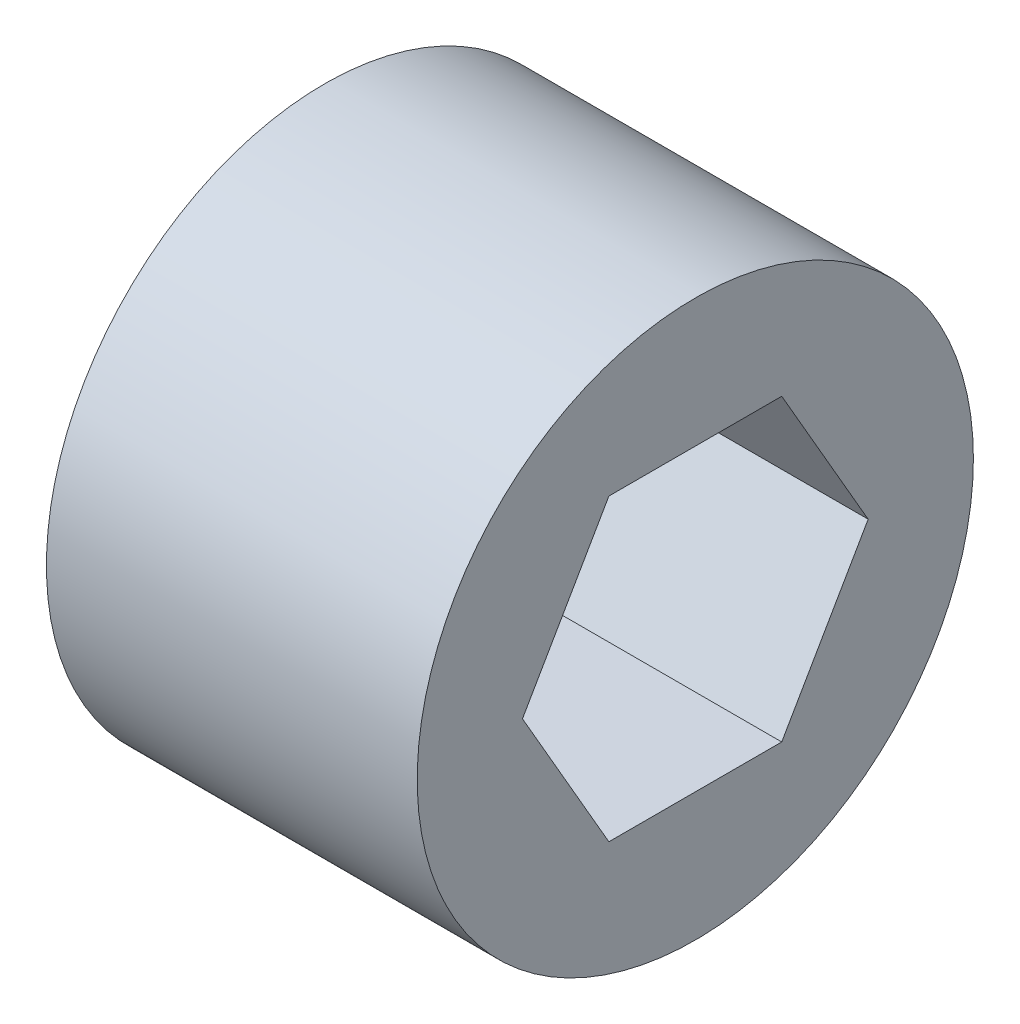
ISO-10303-21;
HEADER;
FILE_DESCRIPTION(('STEP AP214'),'2;1');
FILE_NAME('part.step','',(''),(''),'','','');
FILE_SCHEMA(('AUTOMOTIVE_DESIGN { 1 0 10303 214 1 1 1 1 }'));
ENDSEC;
DATA;
#1=APPLICATION_CONTEXT('core data for automotive mechanical design processes');
#2=APPLICATION_PROTOCOL_DEFINITION('international standard','automotive_design',2000,#1);
#3=PRODUCT_CONTEXT('',#1,'mechanical');
#4=PRODUCT('Part','Part','',(#3));
#5=PRODUCT_RELATED_PRODUCT_CATEGORY('part','',(#4));
#6=PRODUCT_DEFINITION_FORMATION('','',#4);
#7=PRODUCT_DEFINITION_CONTEXT('part definition',#1,'design');
#8=PRODUCT_DEFINITION('design','',#6,#7);
#9=PRODUCT_DEFINITION_SHAPE('','',#8);
#10=(LENGTH_UNIT() NAMED_UNIT(*) SI_UNIT(.MILLI.,.METRE.));
#11=(NAMED_UNIT(*) PLANE_ANGLE_UNIT() SI_UNIT($,.RADIAN.));
#12=(NAMED_UNIT(*) SI_UNIT($,.STERADIAN.) SOLID_ANGLE_UNIT());
#13=UNCERTAINTY_MEASURE_WITH_UNIT(LENGTH_MEASURE(1.E-05),#10,'distance_accuracy_value','');
#14=(GEOMETRIC_REPRESENTATION_CONTEXT(3) GLOBAL_UNCERTAINTY_ASSIGNED_CONTEXT((#13)) GLOBAL_UNIT_ASSIGNED_CONTEXT((#10,
#11,#12)) REPRESENTATION_CONTEXT('',''));
#15=CARTESIAN_POINT('',(0.,0.,0.));
#16=DIRECTION('',(0.,0.,1.));
#17=DIRECTION('',(1.,0.,0.));
#18=AXIS2_PLACEMENT_3D('',#15,#16,#17);
#19=CARTESIAN_POINT('',(6.35,0.,0.));
#20=DIRECTION('',(1.,0.,0.));
#21=DIRECTION('',(0.,0.,-1.));
#22=AXIS2_PLACEMENT_3D('',#19,#20,#21);
#23=PLANE('',#22);
#24=CARTESIAN_POINT('',(6.35,0.,0.));
#25=DIRECTION('',(1.,0.,0.));
#26=DIRECTION('',(0.,0.,-1.));
#27=AXIS2_PLACEMENT_3D('',#24,#25,#26);
#28=CIRCLE('',#27,4.7625);
#29=CARTESIAN_POINT('',(6.35,0.,-4.7625));
#30=VERTEX_POINT('',#29);
#31=EDGE_CURVE('E11',#30,#30,#28,.T.);
#32=ORIENTED_EDGE('',*,*,#31,.T.);
#33=EDGE_LOOP('',(#32));
#34=FACE_BOUND('',#33,.T.);
#35=DIRECTION('',(0.,0.,1.));
#36=VECTOR('',#35,1.);
#37=CARTESIAN_POINT('',(6.35,2.563499953,-1.48003738793214));
#38=LINE('',#37,#36);
#39=CARTESIAN_POINT('',(6.35,2.563499953,-1.48003738793214));
#40=VERTEX_POINT('',#39);
#41=CARTESIAN_POINT('',(6.35,2.563499953,1.48003738793214));
#42=VERTEX_POINT('',#41);
#43=EDGE_CURVE('E100',#40,#42,#38,.T.);
#44=ORIENTED_EDGE('',*,*,#43,.F.);
#45=DIRECTION('',(0.,0.866025403784438,0.5));
#46=VECTOR('',#45,1.);
#47=CARTESIAN_POINT('',(6.35,0.,-2.96007477586429));
#48=LINE('',#47,#46);
#49=CARTESIAN_POINT('',(6.35,0.,-2.96007477586429));
#50=VERTEX_POINT('',#49);
#51=EDGE_CURVE('E92',#50,#40,#48,.T.);
#52=ORIENTED_EDGE('',*,*,#51,.F.);
#53=DIRECTION('',(0.,0.866025403784438,-0.5));
#54=VECTOR('',#53,1.);
#55=CARTESIAN_POINT('',(6.35,-2.563499953,-1.48003738793214));
#56=LINE('',#55,#54);
#57=CARTESIAN_POINT('',(6.35,-2.563499953,-1.48003738793214));
#58=VERTEX_POINT('',#57);
#59=EDGE_CURVE('E120',#58,#50,#56,.T.);
#60=ORIENTED_EDGE('',*,*,#59,.F.);
#61=DIRECTION('',(0.,0.,-1.));
#62=VECTOR('',#61,1.);
#63=CARTESIAN_POINT('',(6.35,-2.563499953,1.48003738793214));
#64=LINE('',#63,#62);
#65=CARTESIAN_POINT('',(6.35,-2.563499953,1.48003738793214));
#66=VERTEX_POINT('',#65);
#67=EDGE_CURVE('E118',#66,#58,#64,.T.);
#68=ORIENTED_EDGE('',*,*,#67,.F.);
#69=DIRECTION('',(0.,-0.866025403784438,-0.5));
#70=VECTOR('',#69,1.);
#71=CARTESIAN_POINT('',(6.35,0.,2.96007477586429));
#72=LINE('',#71,#70);
#73=CARTESIAN_POINT('',(6.35,0.,2.96007477586429));
#74=VERTEX_POINT('',#73);
#75=EDGE_CURVE('E114',#74,#66,#72,.T.);
#76=ORIENTED_EDGE('',*,*,#75,.F.);
#77=DIRECTION('',(0.,-0.866025403784439,0.5));
#78=VECTOR('',#77,1.);
#79=CARTESIAN_POINT('',(6.35,2.563499953,1.48003738793214));
#80=LINE('',#79,#78);
#81=EDGE_CURVE('E112',#42,#74,#80,.T.);
#82=ORIENTED_EDGE('',*,*,#81,.F.);
#83=EDGE_LOOP('',(#44,#52,#60,#68,#76,#82));
#84=FACE_BOUND('',#83,.T.);
#85=ADVANCED_FACE('F39',(#34,#84),#23,.T.);
#86=CARTESIAN_POINT('',(0.,0.,0.));
#87=DIRECTION('',(1.,0.,0.));
#88=DIRECTION('',(0.,0.,-1.));
#89=AXIS2_PLACEMENT_3D('',#86,#87,#88);
#90=PLANE('',#89);
#91=CARTESIAN_POINT('',(0.,0.,0.));
#92=DIRECTION('',(1.,0.,0.));
#93=DIRECTION('',(0.,0.,-1.));
#94=AXIS2_PLACEMENT_3D('',#91,#92,#93);
#95=CIRCLE('',#94,4.7625);
#96=CARTESIAN_POINT('',(0.,0.,-4.7625));
#97=VERTEX_POINT('',#96);
#98=EDGE_CURVE('E43',#97,#97,#95,.T.);
#99=ORIENTED_EDGE('',*,*,#98,.F.);
#100=EDGE_LOOP('',(#99));
#101=FACE_BOUND('',#100,.T.);
#102=DIRECTION('',(0.,0.866025403784438,0.5));
#103=VECTOR('',#102,1.);
#104=CARTESIAN_POINT('',(0.,0.,-2.96007477586429));
#105=LINE('',#104,#103);
#106=CARTESIAN_POINT('',(0.,0.,-2.96007477586429));
#107=VERTEX_POINT('',#106);
#108=CARTESIAN_POINT('',(0.,2.563499953,-1.48003738793214));
#109=VERTEX_POINT('',#108);
#110=EDGE_CURVE('E62',#107,#109,#105,.T.);
#111=ORIENTED_EDGE('',*,*,#110,.T.);
#112=DIRECTION('',(0.,0.,1.));
#113=VECTOR('',#112,1.);
#114=CARTESIAN_POINT('',(0.,2.563499953,-1.48003738793214));
#115=LINE('',#114,#113);
#116=CARTESIAN_POINT('',(0.,2.563499953,1.48003738793214));
#117=VERTEX_POINT('',#116);
#118=EDGE_CURVE('E107',#109,#117,#115,.T.);
#119=ORIENTED_EDGE('',*,*,#118,.T.);
#120=DIRECTION('',(0.,-0.866025403784439,0.5));
#121=VECTOR('',#120,1.);
#122=CARTESIAN_POINT('',(0.,2.563499953,1.48003738793214));
#123=LINE('',#122,#121);
#124=CARTESIAN_POINT('',(0.,0.,2.96007477586429));
#125=VERTEX_POINT('',#124);
#126=EDGE_CURVE('E124',#117,#125,#123,.T.);
#127=ORIENTED_EDGE('',*,*,#126,.T.);
#128=DIRECTION('',(0.,-0.866025403784438,-0.5));
#129=VECTOR('',#128,1.);
#130=CARTESIAN_POINT('',(0.,0.,2.96007477586429));
#131=LINE('',#130,#129);
#132=CARTESIAN_POINT('',(0.,-2.563499953,1.48003738793214));
#133=VERTEX_POINT('',#132);
#134=EDGE_CURVE('E127',#125,#133,#131,.T.);
#135=ORIENTED_EDGE('',*,*,#134,.T.);
#136=DIRECTION('',(0.,0.,-1.));
#137=VECTOR('',#136,1.);
#138=CARTESIAN_POINT('',(0.,-2.563499953,1.48003738793214));
#139=LINE('',#138,#137);
#140=CARTESIAN_POINT('',(0.,-2.563499953,-1.48003738793214));
#141=VERTEX_POINT('',#140);
#142=EDGE_CURVE('E130',#133,#141,#139,.T.);
#143=ORIENTED_EDGE('',*,*,#142,.T.);
#144=DIRECTION('',(0.,0.866025403784438,-0.5));
#145=VECTOR('',#144,1.);
#146=CARTESIAN_POINT('',(0.,-2.563499953,-1.48003738793214));
#147=LINE('',#146,#145);
#148=EDGE_CURVE('E101',#141,#107,#147,.T.);
#149=ORIENTED_EDGE('',*,*,#148,.T.);
#150=EDGE_LOOP('',(#111,#119,#127,#135,#143,#149));
#151=FACE_BOUND('',#150,.T.);
#152=ADVANCED_FACE('F147',(#101,#151),#90,.F.);
#153=CARTESIAN_POINT('',(6.35,0.,0.));
#154=DIRECTION('',(-1.,0.,0.));
#155=DIRECTION('',(0.,0.,1.));
#156=AXIS2_PLACEMENT_3D('',#153,#154,#155);
#157=CYLINDRICAL_SURFACE('',#156,4.7625);
#158=ORIENTED_EDGE('',*,*,#31,.F.);
#159=EDGE_LOOP('',(#158));
#160=FACE_BOUND('',#159,.T.);
#161=ORIENTED_EDGE('',*,*,#98,.T.);
#162=EDGE_LOOP('',(#161));
#163=FACE_BOUND('',#162,.T.);
#164=ADVANCED_FACE('F41',(#160,#163),#157,.T.);
#165=CARTESIAN_POINT('',(6.35,0.,-2.96007477586429));
#166=DIRECTION('',(0.,-0.5,0.866025403784438));
#167=DIRECTION('',(0.,-0.866025403784438,-0.5));
#168=AXIS2_PLACEMENT_3D('',#165,#166,#167);
#169=PLANE('',#168);
#170=ORIENTED_EDGE('',*,*,#110,.F.);
#171=DIRECTION('',(-1.,0.,0.));
#172=VECTOR('',#171,1.);
#173=CARTESIAN_POINT('',(6.35,0.,-2.96007477586429));
#174=LINE('',#173,#172);
#175=EDGE_CURVE('E96',#50,#107,#174,.T.);
#176=ORIENTED_EDGE('',*,*,#175,.F.);
#177=ORIENTED_EDGE('',*,*,#51,.T.);
#178=DIRECTION('',(-1.,0.,0.));
#179=VECTOR('',#178,1.);
#180=CARTESIAN_POINT('',(6.35,2.563499953,-1.48003738793214));
#181=LINE('',#180,#179);
#182=EDGE_CURVE('E95',#40,#109,#181,.T.);
#183=ORIENTED_EDGE('',*,*,#182,.T.);
#184=EDGE_LOOP('',(#170,#176,#177,#183));
#185=FACE_BOUND('',#184,.T.);
#186=ADVANCED_FACE('F94',(#185),#169,.T.);
#187=CARTESIAN_POINT('',(6.35,2.563499953,-1.48003738793214));
#188=DIRECTION('',(0.,-1.,0.));
#189=DIRECTION('',(0.,0.,-1.));
#190=AXIS2_PLACEMENT_3D('',#187,#188,#189);
#191=PLANE('',#190);
#192=ORIENTED_EDGE('',*,*,#118,.F.);
#193=ORIENTED_EDGE('',*,*,#182,.F.);
#194=ORIENTED_EDGE('',*,*,#43,.T.);
#195=DIRECTION('',(-1.,0.,0.));
#196=VECTOR('',#195,1.);
#197=CARTESIAN_POINT('',(6.35,2.563499953,1.48003738793214));
#198=LINE('',#197,#196);
#199=EDGE_CURVE('E108',#42,#117,#198,.T.);
#200=ORIENTED_EDGE('',*,*,#199,.T.);
#201=EDGE_LOOP('',(#192,#193,#194,#200));
#202=FACE_BOUND('',#201,.T.);
#203=ADVANCED_FACE('F104',(#202),#191,.T.);
#204=CARTESIAN_POINT('',(6.35,2.563499953,1.48003738793214));
#205=DIRECTION('',(0.,-0.5,-0.866025403784439));
#206=DIRECTION('',(0.,0.866025403784439,-0.5));
#207=AXIS2_PLACEMENT_3D('',#204,#205,#206);
#208=PLANE('',#207);
#209=ORIENTED_EDGE('',*,*,#126,.F.);
#210=ORIENTED_EDGE('',*,*,#199,.F.);
#211=ORIENTED_EDGE('',*,*,#81,.T.);
#212=DIRECTION('',(-1.,0.,0.));
#213=VECTOR('',#212,1.);
#214=CARTESIAN_POINT('',(6.35,0.,2.96007477586429));
#215=LINE('',#214,#213);
#216=EDGE_CURVE('E139',#74,#125,#215,.T.);
#217=ORIENTED_EDGE('',*,*,#216,.T.);
#218=EDGE_LOOP('',(#209,#210,#211,#217));
#219=FACE_BOUND('',#218,.T.);
#220=ADVANCED_FACE('F143',(#219),#208,.T.);
#221=CARTESIAN_POINT('',(6.35,0.,2.96007477586429));
#222=DIRECTION('',(0.,0.5,-0.866025403784438));
#223=DIRECTION('',(0.,0.866025403784439,0.5));
#224=AXIS2_PLACEMENT_3D('',#221,#222,#223);
#225=PLANE('',#224);
#226=ORIENTED_EDGE('',*,*,#134,.F.);
#227=ORIENTED_EDGE('',*,*,#216,.F.);
#228=ORIENTED_EDGE('',*,*,#75,.T.);
#229=DIRECTION('',(-1.,0.,0.));
#230=VECTOR('',#229,1.);
#231=CARTESIAN_POINT('',(6.35,-2.563499953,1.48003738793214));
#232=LINE('',#231,#230);
#233=EDGE_CURVE('E137',#66,#133,#232,.T.);
#234=ORIENTED_EDGE('',*,*,#233,.T.);
#235=EDGE_LOOP('',(#226,#227,#228,#234));
#236=FACE_BOUND('',#235,.T.);
#237=ADVANCED_FACE('F155',(#236),#225,.T.);
#238=CARTESIAN_POINT('',(6.35,-2.563499953,1.48003738793214));
#239=DIRECTION('',(0.,1.,0.));
#240=DIRECTION('',(0.,0.,1.));
#241=AXIS2_PLACEMENT_3D('',#238,#239,#240);
#242=PLANE('',#241);
#243=ORIENTED_EDGE('',*,*,#142,.F.);
#244=ORIENTED_EDGE('',*,*,#233,.F.);
#245=ORIENTED_EDGE('',*,*,#67,.T.);
#246=DIRECTION('',(-1.,0.,0.));
#247=VECTOR('',#246,1.);
#248=CARTESIAN_POINT('',(6.35,-2.563499953,-1.48003738793214));
#249=LINE('',#248,#247);
#250=EDGE_CURVE('E54',#58,#141,#249,.T.);
#251=ORIENTED_EDGE('',*,*,#250,.T.);
#252=EDGE_LOOP('',(#243,#244,#245,#251));
#253=FACE_BOUND('',#252,.T.);
#254=ADVANCED_FACE('F153',(#253),#242,.T.);
#255=CARTESIAN_POINT('',(6.35,-2.563499953,-1.48003738793214));
#256=DIRECTION('',(0.,0.5,0.866025403784438));
#257=DIRECTION('',(0.,-0.866025403784439,0.5));
#258=AXIS2_PLACEMENT_3D('',#255,#256,#257);
#259=PLANE('',#258);
#260=ORIENTED_EDGE('',*,*,#148,.F.);
#261=ORIENTED_EDGE('',*,*,#250,.F.);
#262=ORIENTED_EDGE('',*,*,#59,.T.);
#263=ORIENTED_EDGE('',*,*,#175,.T.);
#264=EDGE_LOOP('',(#260,#261,#262,#263));
#265=FACE_BOUND('',#264,.T.);
#266=ADVANCED_FACE('F149',(#265),#259,.T.);
#267=CLOSED_SHELL('',(#85,#152,#164,#186,#203,#220,#237,#254,#266));
#268=MANIFOLD_SOLID_BREP('B2',#267);
#269=ADVANCED_BREP_SHAPE_REPRESENTATION('',(#18,#268),#14);
#270=SHAPE_DEFINITION_REPRESENTATION(#9,#269);
ENDSEC;
END-ISO-10303-21;
